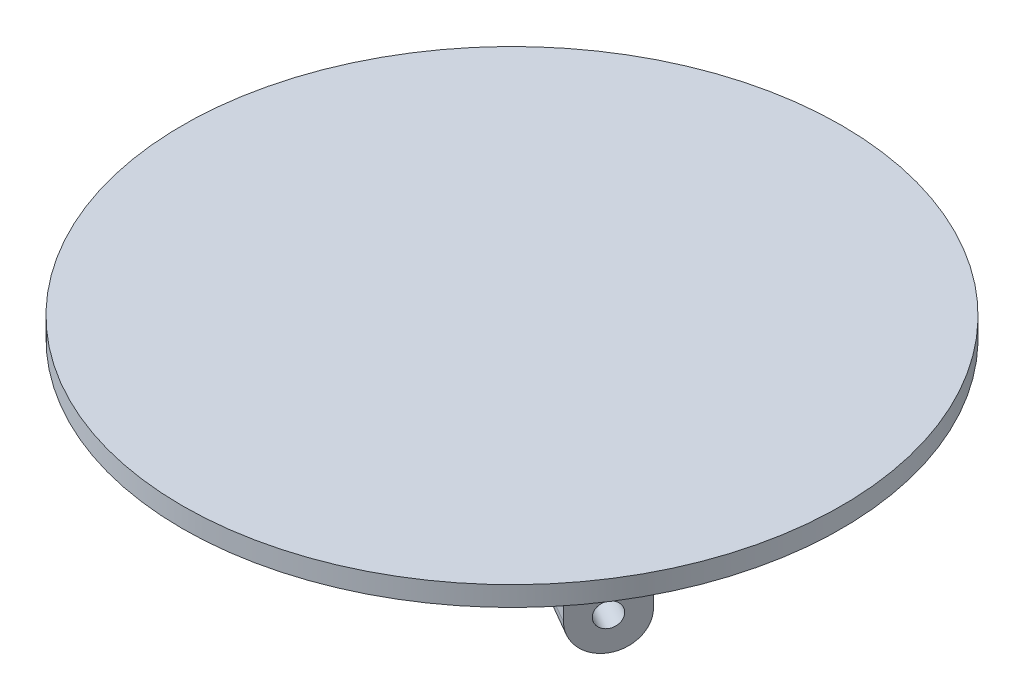
ISO-10303-21;
HEADER;
FILE_DESCRIPTION(('STEP AP214'),'2;1');
FILE_NAME('part.step','',(''),(''),'','','');
FILE_SCHEMA(('AUTOMOTIVE_DESIGN { 1 0 10303 214 1 1 1 1 }'));
ENDSEC;
DATA;
#1=APPLICATION_CONTEXT('core data for automotive mechanical design processes');
#2=APPLICATION_PROTOCOL_DEFINITION('international standard','automotive_design',2000,#1);
#3=PRODUCT_CONTEXT('',#1,'mechanical');
#4=PRODUCT('Part','Part','',(#3));
#5=PRODUCT_RELATED_PRODUCT_CATEGORY('part','',(#4));
#6=PRODUCT_DEFINITION_FORMATION('','',#4);
#7=PRODUCT_DEFINITION_CONTEXT('part definition',#1,'design');
#8=PRODUCT_DEFINITION('design','',#6,#7);
#9=PRODUCT_DEFINITION_SHAPE('','',#8);
#10=(LENGTH_UNIT() NAMED_UNIT(*) SI_UNIT(.MILLI.,.METRE.));
#11=(NAMED_UNIT(*) PLANE_ANGLE_UNIT() SI_UNIT($,.RADIAN.));
#12=(NAMED_UNIT(*) SI_UNIT($,.STERADIAN.) SOLID_ANGLE_UNIT());
#13=UNCERTAINTY_MEASURE_WITH_UNIT(LENGTH_MEASURE(1.E-05),#10,'distance_accuracy_value','');
#14=(GEOMETRIC_REPRESENTATION_CONTEXT(3) GLOBAL_UNCERTAINTY_ASSIGNED_CONTEXT((#13)) GLOBAL_UNIT_ASSIGNED_CONTEXT((#10,
#11,#12)) REPRESENTATION_CONTEXT('',''));
#15=CARTESIAN_POINT('',(0.,0.,0.));
#16=DIRECTION('',(0.,0.,1.));
#17=DIRECTION('',(1.,0.,0.));
#18=AXIS2_PLACEMENT_3D('',#15,#16,#17);
#19=CARTESIAN_POINT('',(4.99999999999984,17.,-40.));
#20=DIRECTION('',(-1.,0.,0.));
#21=DIRECTION('',(0.,0.,1.));
#22=AXIS2_PLACEMENT_3D('',#19,#20,#21);
#23=PLANE('',#22);
#24=DIRECTION('',(0.,-1.,0.));
#25=VECTOR('',#24,1.);
#26=CARTESIAN_POINT('',(4.99999999999984,17.,-40.));
#27=LINE('',#26,#25);
#28=CARTESIAN_POINT('',(4.99999999999984,12.,-40.));
#29=VERTEX_POINT('',#28);
#30=CARTESIAN_POINT('',(4.99999999999984,5.,-40.));
#31=VERTEX_POINT('',#30);
#32=EDGE_CURVE('E206',#29,#31,#27,.T.);
#33=ORIENTED_EDGE('',*,*,#32,.F.);
#34=DIRECTION('',(0.,0.,-1.));
#35=VECTOR('',#34,1.);
#36=CARTESIAN_POINT('',(4.99999999999985,12.,-35.));
#37=LINE('',#36,#35);
#38=CARTESIAN_POINT('',(4.99999999999993,12.,-35.));
#39=VERTEX_POINT('',#38);
#40=EDGE_CURVE('E304',#29,#39,#37,.F.);
#41=ORIENTED_EDGE('',*,*,#40,.T.);
#42=DIRECTION('',(0.,1.,0.));
#43=VECTOR('',#42,1.);
#44=CARTESIAN_POINT('',(4.99999999999993,0.,-35.));
#45=LINE('',#44,#43);
#46=CARTESIAN_POINT('',(4.99999999999993,5.,-35.));
#47=VERTEX_POINT('',#46);
#48=EDGE_CURVE('E190',#47,#39,#45,.T.);
#49=ORIENTED_EDGE('',*,*,#48,.F.);
#50=DIRECTION('',(0.,0.,-1.));
#51=VECTOR('',#50,1.);
#52=CARTESIAN_POINT('',(4.99999999999984,5.,-40.));
#53=LINE('',#52,#51);
#54=EDGE_CURVE('E215',#47,#31,#53,.T.);
#55=ORIENTED_EDGE('',*,*,#54,.T.);
#56=EDGE_LOOP('',(#33,#41,#49,#55));
#57=FACE_BOUND('',#56,.T.);
#58=ADVANCED_FACE('F39',(#57),#23,.F.);
#59=CARTESIAN_POINT('',(-5.00000000000016,17.,-40.));
#60=DIRECTION('',(0.,0.,1.));
#61=DIRECTION('',(1.,0.,0.));
#62=AXIS2_PLACEMENT_3D('',#59,#60,#61);
#63=PLANE('',#62);
#64=CARTESIAN_POINT('',(-1.78260027118137E-13,5.,-40.));
#65=DIRECTION('',(0.,0.,-1.));
#66=DIRECTION('',(-1.,0.,0.));
#67=AXIS2_PLACEMENT_3D('',#64,#65,#66);
#68=CIRCLE('',#67,1.79999999999999);
#69=CARTESIAN_POINT('',(-1.80000000000017,5.,-40.));
#70=VERTEX_POINT('',#69);
#71=EDGE_CURVE('E397',#70,#70,#68,.T.);
#72=ORIENTED_EDGE('',*,*,#71,.F.);
#73=EDGE_LOOP('',(#72));
#74=FACE_BOUND('',#73,.T.);
#75=DIRECTION('',(0.,-1.,0.));
#76=VECTOR('',#75,1.);
#77=CARTESIAN_POINT('',(-5.00000000000016,17.,-40.));
#78=LINE('',#77,#76);
#79=CARTESIAN_POINT('',(-5.00000000000016,12.,-40.));
#80=VERTEX_POINT('',#79);
#81=CARTESIAN_POINT('',(-5.00000000000016,5.,-40.));
#82=VERTEX_POINT('',#81);
#83=EDGE_CURVE('E204',#80,#82,#78,.T.);
#84=ORIENTED_EDGE('',*,*,#83,.F.);
#85=DIRECTION('',(-1.,0.,0.));
#86=VECTOR('',#85,1.);
#87=CARTESIAN_POINT('',(4.99999999999984,12.,-40.));
#88=LINE('',#87,#86);
#89=EDGE_CURVE('E11',#80,#29,#88,.F.);
#90=ORIENTED_EDGE('',*,*,#89,.T.);
#91=ORIENTED_EDGE('',*,*,#32,.T.);
#92=CARTESIAN_POINT('',(-1.63931368479808E-13,5.,-40.));
#93=DIRECTION('',(0.,0.,1.));
#94=DIRECTION('',(1.,0.,0.));
#95=AXIS2_PLACEMENT_3D('',#92,#93,#94);
#96=CIRCLE('',#95,5.);
#97=CARTESIAN_POINT('',(-1.63931368479808E-13,0.,-40.));
#98=VERTEX_POINT('',#97);
#99=EDGE_CURVE('E200',#31,#98,#96,.F.);
#100=ORIENTED_EDGE('',*,*,#99,.T.);
#101=CARTESIAN_POINT('',(-1.63931368479808E-13,5.,-40.));
#102=DIRECTION('',(0.,0.,1.));
#103=DIRECTION('',(1.,0.,0.));
#104=AXIS2_PLACEMENT_3D('',#101,#102,#103);
#105=CIRCLE('',#104,5.);
#106=EDGE_CURVE('E213',#98,#82,#105,.F.);
#107=ORIENTED_EDGE('',*,*,#106,.T.);
#108=EDGE_LOOP('',(#84,#90,#91,#100,#107));
#109=FACE_BOUND('',#108,.T.);
#110=ADVANCED_FACE('F411',(#74,#109),#63,.F.);
#111=CARTESIAN_POINT('',(-5.00000000000007,17.,-2.88675134594814));
#112=DIRECTION('',(1.,0.,0.));
#113=DIRECTION('',(0.,0.,-1.));
#114=AXIS2_PLACEMENT_3D('',#111,#112,#113);
#115=PLANE('',#114);
#116=DIRECTION('',(0.,-1.,0.));
#117=VECTOR('',#116,1.);
#118=CARTESIAN_POINT('',(-5.00000000000015,0.,-35.));
#119=LINE('',#118,#117);
#120=CARTESIAN_POINT('',(-5.00000000000015,12.,-35.));
#121=VERTEX_POINT('',#120);
#122=CARTESIAN_POINT('',(-5.00000000000015,5.,-35.));
#123=VERTEX_POINT('',#122);
#124=EDGE_CURVE('E181',#121,#123,#119,.T.);
#125=ORIENTED_EDGE('',*,*,#124,.F.);
#126=DIRECTION('',(0.,0.,1.));
#127=VECTOR('',#126,1.);
#128=CARTESIAN_POINT('',(-5.00000000000016,12.,-40.));
#129=LINE('',#128,#127);
#130=EDGE_CURVE('E48',#121,#80,#129,.F.);
#131=ORIENTED_EDGE('',*,*,#130,.T.);
#132=ORIENTED_EDGE('',*,*,#83,.T.);
#133=DIRECTION('',(0.,0.,1.));
#134=VECTOR('',#133,1.);
#135=CARTESIAN_POINT('',(-5.00000000000015,5.,-35.));
#136=LINE('',#135,#134);
#137=EDGE_CURVE('E198',#82,#123,#136,.T.);
#138=ORIENTED_EDGE('',*,*,#137,.T.);
#139=EDGE_LOOP('',(#125,#131,#132,#138));
#140=FACE_BOUND('',#139,.T.);
#141=ADVANCED_FACE('F203',(#140),#115,.F.);
#142=CARTESIAN_POINT('',(-37.1410161513774,17.,15.6698729810781));
#143=DIRECTION('',(0.500000000000006,0.,0.866025403784435));
#144=DIRECTION('',(0.866025403784435,0.,-0.500000000000006));
#145=AXIS2_PLACEMENT_3D('',#142,#143,#144);
#146=PLANE('',#145);
#147=DIRECTION('',(0.,-1.,0.));
#148=VECTOR('',#147,1.);
#149=CARTESIAN_POINT('',(-37.1410161513774,17.,15.6698729810781));
#150=LINE('',#149,#148);
#151=CARTESIAN_POINT('',(-37.1410161513774,12.,15.6698729810781));
#152=VERTEX_POINT('',#151);
#153=CARTESIAN_POINT('',(-37.1410161513774,5.,15.6698729810781));
#154=VERTEX_POINT('',#153);
#155=EDGE_CURVE('E395',#152,#154,#150,.T.);
#156=ORIENTED_EDGE('',*,*,#155,.F.);
#157=DIRECTION('',(-0.866025403784435,0.,0.500000000000006));
#158=VECTOR('',#157,1.);
#159=CARTESIAN_POINT('',(-32.8108891324552,12.,13.1698729810781));
#160=LINE('',#159,#158);
#161=CARTESIAN_POINT('',(-32.8108891324553,12.,13.169872981078));
#162=VERTEX_POINT('',#161);
#163=EDGE_CURVE('E285',#152,#162,#160,.F.);
#164=ORIENTED_EDGE('',*,*,#163,.T.);
#165=DIRECTION('',(0.,1.,0.));
#166=VECTOR('',#165,1.);
#167=CARTESIAN_POINT('',(-32.8108891324553,0.,13.169872981078));
#168=LINE('',#167,#166);
#169=CARTESIAN_POINT('',(-32.8108891324553,5.,13.169872981078));
#170=VERTEX_POINT('',#169);
#171=EDGE_CURVE('E386',#170,#162,#168,.T.);
#172=ORIENTED_EDGE('',*,*,#171,.F.);
#173=DIRECTION('',(-0.866025403784435,0.,0.500000000000006));
#174=VECTOR('',#173,1.);
#175=CARTESIAN_POINT('',(-37.1410161513774,5.,15.6698729810781));
#176=LINE('',#175,#174);
#177=EDGE_CURVE('E232',#170,#154,#176,.T.);
#178=ORIENTED_EDGE('',*,*,#177,.T.);
#179=EDGE_LOOP('',(#156,#164,#172,#178));
#180=FACE_BOUND('',#179,.T.);
#181=ADVANCED_FACE('F434',(#180),#146,.F.);
#182=CARTESIAN_POINT('',(-32.1410161513774,17.,24.3301270189225));
#183=DIRECTION('',(0.866025403784436,0.,-0.500000000000004));
#184=DIRECTION('',(-0.500000000000004,0.,-0.866025403784436));
#185=AXIS2_PLACEMENT_3D('',#182,#183,#184);
#186=PLANE('',#185);
#187=CARTESIAN_POINT('',(-34.6410161513774,5.,20.0000000000003));
#188=DIRECTION('',(-0.866025403784435,0.,0.500000000000006));
#189=DIRECTION('',(0.500000000000007,0.,0.866025403784435));
#190=AXIS2_PLACEMENT_3D('',#187,#188,#189);
#191=CIRCLE('',#190,1.79999999999999);
#192=CARTESIAN_POINT('',(-33.7410161513774,5.,21.5588457268123));
#193=VERTEX_POINT('',#192);
#194=EDGE_CURVE('E375',#193,#193,#191,.T.);
#195=ORIENTED_EDGE('',*,*,#194,.F.);
#196=EDGE_LOOP('',(#195));
#197=FACE_BOUND('',#196,.T.);
#198=DIRECTION('',(0.,-1.,0.));
#199=VECTOR('',#198,1.);
#200=CARTESIAN_POINT('',(-32.1410161513774,17.,24.3301270189225));
#201=LINE('',#200,#199);
#202=CARTESIAN_POINT('',(-32.1410161513774,12.,24.3301270189225));
#203=VERTEX_POINT('',#202);
#204=CARTESIAN_POINT('',(-32.1410161513774,5.,24.3301270189225));
#205=VERTEX_POINT('',#204);
#206=EDGE_CURVE('E393',#203,#205,#201,.T.);
#207=ORIENTED_EDGE('',*,*,#206,.F.);
#208=DIRECTION('',(0.500000000000004,0.,0.866025403784436));
#209=VECTOR('',#208,1.);
#210=CARTESIAN_POINT('',(-37.1410161513774,12.,15.6698729810781));
#211=LINE('',#210,#209);
#212=EDGE_CURVE('E290',#203,#152,#211,.F.);
#213=ORIENTED_EDGE('',*,*,#212,.T.);
#214=ORIENTED_EDGE('',*,*,#155,.T.);
#215=CARTESIAN_POINT('',(-34.6410161513774,5.,20.0000000000003));
#216=DIRECTION('',(0.866025403784436,0.,-0.500000000000004));
#217=DIRECTION('',(-0.500000000000004,0.,-0.866025403784436));
#218=AXIS2_PLACEMENT_3D('',#215,#216,#217);
#219=CIRCLE('',#218,5.);
#220=CARTESIAN_POINT('',(-34.6410161513774,0.,20.0000000000003));
#221=VERTEX_POINT('',#220);
#222=EDGE_CURVE('E227',#154,#221,#219,.F.);
#223=ORIENTED_EDGE('',*,*,#222,.T.);
#224=CARTESIAN_POINT('',(-34.6410161513774,5.,20.0000000000003));
#225=DIRECTION('',(0.866025403784436,0.,-0.500000000000004));
#226=DIRECTION('',(-0.500000000000004,0.,-0.866025403784436));
#227=AXIS2_PLACEMENT_3D('',#224,#225,#226);
#228=CIRCLE('',#227,5.);
#229=EDGE_CURVE('E229',#221,#205,#228,.F.);
#230=ORIENTED_EDGE('',*,*,#229,.T.);
#231=EDGE_LOOP('',(#207,#213,#214,#223,#230));
#232=FACE_BOUND('',#231,.T.);
#233=ADVANCED_FACE('F442',(#197,#232),#186,.F.);
#234=CARTESIAN_POINT('',(0.,17.,5.77350269189633));
#235=DIRECTION('',(-0.500000000000006,0.,-0.866025403784435));
#236=DIRECTION('',(-0.866025403784435,0.,0.500000000000006));
#237=AXIS2_PLACEMENT_3D('',#234,#235,#236);
#238=PLANE('',#237);
#239=DIRECTION('',(0.,-1.,0.));
#240=VECTOR('',#239,1.);
#241=CARTESIAN_POINT('',(-27.8108891324552,0.,21.8301270189224));
#242=LINE('',#241,#240);
#243=CARTESIAN_POINT('',(-27.8108891324552,12.,21.8301270189224));
#244=VERTEX_POINT('',#243);
#245=CARTESIAN_POINT('',(-27.8108891324552,5.,21.8301270189224));
#246=VERTEX_POINT('',#245);
#247=EDGE_CURVE('E384',#244,#246,#242,.T.);
#248=ORIENTED_EDGE('',*,*,#247,.F.);
#249=DIRECTION('',(0.866025403784435,0.,-0.500000000000006));
#250=VECTOR('',#249,1.);
#251=CARTESIAN_POINT('',(-32.1410161513774,12.,24.3301270189225));
#252=LINE('',#251,#250);
#253=EDGE_CURVE('E292',#244,#203,#252,.F.);
#254=ORIENTED_EDGE('',*,*,#253,.T.);
#255=ORIENTED_EDGE('',*,*,#206,.T.);
#256=DIRECTION('',(0.866025403784435,0.,-0.500000000000006));
#257=VECTOR('',#256,1.);
#258=CARTESIAN_POINT('',(-27.8108891324552,5.,21.8301270189225));
#259=LINE('',#258,#257);
#260=EDGE_CURVE('E218',#205,#246,#259,.T.);
#261=ORIENTED_EDGE('',*,*,#260,.T.);
#262=EDGE_LOOP('',(#248,#254,#255,#261));
#263=FACE_BOUND('',#262,.T.);
#264=ADVANCED_FACE('F446',(#263),#238,.F.);
#265=CARTESIAN_POINT('',(32.1410161513779,17.,24.3301270189218));
#266=DIRECTION('',(0.49999999999999,0.,-0.866025403784444));
#267=DIRECTION('',(-0.866025403784445,0.,-0.49999999999999));
#268=AXIS2_PLACEMENT_3D('',#265,#266,#267);
#269=PLANE('',#268);
#270=DIRECTION('',(0.,-1.,0.));
#271=VECTOR('',#270,1.);
#272=CARTESIAN_POINT('',(32.1410161513779,17.,24.3301270189218));
#273=LINE('',#272,#271);
#274=CARTESIAN_POINT('',(32.1410161513779,12.,24.3301270189218));
#275=VERTEX_POINT('',#274);
#276=CARTESIAN_POINT('',(32.1410161513779,5.,24.3301270189218));
#277=VERTEX_POINT('',#276);
#278=EDGE_CURVE('E391',#275,#277,#273,.T.);
#279=ORIENTED_EDGE('',*,*,#278,.F.);
#280=DIRECTION('',(0.866025403784445,0.,0.49999999999999));
#281=VECTOR('',#280,1.);
#282=CARTESIAN_POINT('',(27.8108891324556,12.,21.8301270189218));
#283=LINE('',#282,#281);
#284=CARTESIAN_POINT('',(27.8108891324556,12.,21.8301270189219));
#285=VERTEX_POINT('',#284);
#286=EDGE_CURVE('E294',#275,#285,#283,.F.);
#287=ORIENTED_EDGE('',*,*,#286,.T.);
#288=DIRECTION('',(0.,1.,0.));
#289=VECTOR('',#288,1.);
#290=CARTESIAN_POINT('',(27.8108891324556,0.,21.8301270189219));
#291=LINE('',#290,#289);
#292=CARTESIAN_POINT('',(27.8108891324556,5.,21.8301270189219));
#293=VERTEX_POINT('',#292);
#294=EDGE_CURVE('E381',#293,#285,#291,.T.);
#295=ORIENTED_EDGE('',*,*,#294,.F.);
#296=DIRECTION('',(0.866025403784445,0.,0.49999999999999));
#297=VECTOR('',#296,1.);
#298=CARTESIAN_POINT('',(32.1410161513779,5.,24.3301270189218));
#299=LINE('',#298,#297);
#300=EDGE_CURVE('E252',#293,#277,#299,.T.);
#301=ORIENTED_EDGE('',*,*,#300,.T.);
#302=EDGE_LOOP('',(#279,#287,#295,#301));
#303=FACE_BOUND('',#302,.T.);
#304=ADVANCED_FACE('F450',(#303),#269,.F.);
#305=CARTESIAN_POINT('',(37.1410161513778,17.,15.6698729810773));
#306=DIRECTION('',(-0.866025403784443,0.,-0.499999999999992));
#307=DIRECTION('',(-0.499999999999992,0.,0.866025403784443));
#308=AXIS2_PLACEMENT_3D('',#305,#306,#307);
#309=PLANE('',#308);
#310=CARTESIAN_POINT('',(34.6410161513778,5.,19.9999999999995));
#311=DIRECTION('',(0.866025403784445,0.,0.49999999999999));
#312=DIRECTION('',(0.49999999999999,0.,-0.866025403784445));
#313=AXIS2_PLACEMENT_3D('',#310,#311,#312);
#314=CIRCLE('',#313,1.79999999999999);
#315=CARTESIAN_POINT('',(35.5410161513778,5.,18.4411542731875));
#316=VERTEX_POINT('',#315);
#317=EDGE_CURVE('E367',#316,#316,#314,.T.);
#318=ORIENTED_EDGE('',*,*,#317,.F.);
#319=EDGE_LOOP('',(#318));
#320=FACE_BOUND('',#319,.T.);
#321=DIRECTION('',(0.,-1.,0.));
#322=VECTOR('',#321,1.);
#323=CARTESIAN_POINT('',(37.1410161513778,17.,15.6698729810773));
#324=LINE('',#323,#322);
#325=CARTESIAN_POINT('',(37.1410161513778,12.,15.6698729810773));
#326=VERTEX_POINT('',#325);
#327=CARTESIAN_POINT('',(37.1410161513778,5.,15.6698729810773));
#328=VERTEX_POINT('',#327);
#329=EDGE_CURVE('E389',#326,#328,#324,.T.);
#330=ORIENTED_EDGE('',*,*,#329,.F.);
#331=DIRECTION('',(0.499999999999992,0.,-0.866025403784443));
#332=VECTOR('',#331,1.);
#333=CARTESIAN_POINT('',(32.1410161513779,12.,24.3301270189218));
#334=LINE('',#333,#332);
#335=EDGE_CURVE('E297',#326,#275,#334,.F.);
#336=ORIENTED_EDGE('',*,*,#335,.T.);
#337=ORIENTED_EDGE('',*,*,#278,.T.);
#338=CARTESIAN_POINT('',(34.6410161513778,5.,19.9999999999995));
#339=DIRECTION('',(-0.866025403784443,0.,-0.499999999999992));
#340=DIRECTION('',(-0.499999999999992,0.,0.866025403784443));
#341=AXIS2_PLACEMENT_3D('',#338,#339,#340);
#342=CIRCLE('',#341,5.);
#343=CARTESIAN_POINT('',(34.6410161513778,0.,19.9999999999995));
#344=VERTEX_POINT('',#343);
#345=EDGE_CURVE('E247',#277,#344,#342,.F.);
#346=ORIENTED_EDGE('',*,*,#345,.T.);
#347=CARTESIAN_POINT('',(34.6410161513778,5.,19.9999999999995));
#348=DIRECTION('',(-0.866025403784443,0.,-0.499999999999992));
#349=DIRECTION('',(-0.499999999999992,0.,0.866025403784443));
#350=AXIS2_PLACEMENT_3D('',#347,#348,#349);
#351=CIRCLE('',#350,5.);
#352=EDGE_CURVE('E249',#344,#328,#351,.F.);
#353=ORIENTED_EDGE('',*,*,#352,.T.);
#354=EDGE_LOOP('',(#330,#336,#337,#346,#353));
#355=FACE_BOUND('',#354,.T.);
#356=ADVANCED_FACE('F454',(#320,#355),#309,.F.);
#357=CARTESIAN_POINT('',(5.00000000000002,17.,-2.88675134594823));
#358=DIRECTION('',(-0.49999999999999,0.,0.866025403784444));
#359=DIRECTION('',(0.866025403784445,0.,0.49999999999999));
#360=AXIS2_PLACEMENT_3D('',#357,#358,#359);
#361=PLANE('',#360);
#362=DIRECTION('',(0.,-1.,0.));
#363=VECTOR('',#362,1.);
#364=CARTESIAN_POINT('',(32.8108891324555,0.,13.1698729810774));
#365=LINE('',#364,#363);
#366=CARTESIAN_POINT('',(32.8108891324555,12.,13.1698729810774));
#367=VERTEX_POINT('',#366);
#368=CARTESIAN_POINT('',(32.8108891324555,5.,13.1698729810774));
#369=VERTEX_POINT('',#368);
#370=EDGE_CURVE('E239',#367,#369,#365,.T.);
#371=ORIENTED_EDGE('',*,*,#370,.F.);
#372=DIRECTION('',(-0.866025403784445,0.,-0.49999999999999));
#373=VECTOR('',#372,1.);
#374=CARTESIAN_POINT('',(37.1410161513778,12.,15.6698729810773));
#375=LINE('',#374,#373);
#376=EDGE_CURVE('E301',#367,#326,#375,.F.);
#377=ORIENTED_EDGE('',*,*,#376,.T.);
#378=ORIENTED_EDGE('',*,*,#329,.T.);
#379=DIRECTION('',(-0.866025403784445,0.,-0.49999999999999));
#380=VECTOR('',#379,1.);
#381=CARTESIAN_POINT('',(32.8108891324556,5.,13.1698729810774));
#382=LINE('',#381,#380);
#383=EDGE_CURVE('E235',#328,#369,#382,.T.);
#384=ORIENTED_EDGE('',*,*,#383,.T.);
#385=EDGE_LOOP('',(#371,#377,#378,#384));
#386=FACE_BOUND('',#385,.T.);
#387=ADVANCED_FACE('F358',(#386),#361,.F.);
#388=CARTESIAN_POINT('',(-5.00100000000016,14.,0.));
#389=DIRECTION('',(0.,1.,0.));
#390=DIRECTION('',(0.,0.,1.));
#391=AXIS2_PLACEMENT_3D('',#388,#389,#390);
#392=PLANE('',#391);
#393=DIRECTION('',(-0.500000000000004,0.,-0.866025403784436));
#394=VECTOR('',#393,1.);
#395=CARTESIAN_POINT('',(-31.0788383248863,14.,12.1698729810781));
#396=LINE('',#395,#394);
#397=CARTESIAN_POINT('',(-25.0788383248863,14.,22.5621778264913));
#398=VERTEX_POINT('',#397);
#399=CARTESIAN_POINT('',(-32.0788383248864,14.,10.4378221735092));
#400=VERTEX_POINT('',#399);
#401=EDGE_CURVE('E280',#398,#400,#396,.T.);
#402=ORIENTED_EDGE('',*,*,#401,.T.);
#403=DIRECTION('',(-0.866025403784435,0.,0.500000000000006));
#404=VECTOR('',#403,1.);
#405=CARTESIAN_POINT('',(-38.1410161513774,14.,13.9378221735093));
#406=LINE('',#405,#404);
#407=CARTESIAN_POINT('',(-39.8730669589463,14.,14.9378221735093));
#408=VERTEX_POINT('',#407);
#409=EDGE_CURVE('E282',#400,#408,#406,.T.);
#410=ORIENTED_EDGE('',*,*,#409,.T.);
#411=DIRECTION('',(0.500000000000004,0.,0.866025403784436));
#412=VECTOR('',#411,1.);
#413=CARTESIAN_POINT('',(-33.8730669589462,14.,25.3301270189225));
#414=LINE('',#413,#412);
#415=CARTESIAN_POINT('',(-32.8730669589462,14.,27.0621778264914));
#416=VERTEX_POINT('',#415);
#417=EDGE_CURVE('E278',#408,#416,#414,.T.);
#418=ORIENTED_EDGE('',*,*,#417,.T.);
#419=DIRECTION('',(0.866025403784435,0.,-0.500000000000006));
#420=VECTOR('',#419,1.);
#421=CARTESIAN_POINT('',(-26.8108891324552,14.,23.5621778264913));
#422=LINE('',#421,#420);
#423=EDGE_CURVE('E276',#416,#398,#422,.T.);
#424=ORIENTED_EDGE('',*,*,#423,.T.);
#425=EDGE_LOOP('',(#402,#410,#418,#424));
#426=FACE_BOUND('',#425,.T.);
#427=DIRECTION('',(-0.499999999999992,0.,0.866025403784443));
#428=VECTOR('',#427,1.);
#429=CARTESIAN_POINT('',(26.0788383248867,14.,20.8301270189219));
#430=LINE('',#429,#428);
#431=CARTESIAN_POINT('',(32.0788383248866,14.,10.4378221735085));
#432=VERTEX_POINT('',#431);
#433=CARTESIAN_POINT('',(25.0788383248867,14.,22.5621778264907));
#434=VERTEX_POINT('',#433);
#435=EDGE_CURVE('E269',#432,#434,#430,.T.);
#436=ORIENTED_EDGE('',*,*,#435,.T.);
#437=DIRECTION('',(0.866025403784445,0.,0.49999999999999));
#438=VECTOR('',#437,1.);
#439=CARTESIAN_POINT('',(31.1410161513779,14.,26.0621778264907));
#440=LINE('',#439,#438);
#441=CARTESIAN_POINT('',(32.8730669589468,14.,27.0621778264906));
#442=VERTEX_POINT('',#441);
#443=EDGE_CURVE('E273',#434,#442,#440,.T.);
#444=ORIENTED_EDGE('',*,*,#443,.T.);
#445=DIRECTION('',(0.499999999999992,0.,-0.866025403784443));
#446=VECTOR('',#445,1.);
#447=CARTESIAN_POINT('',(38.8730669589467,14.,16.6698729810773));
#448=LINE('',#447,#446);
#449=CARTESIAN_POINT('',(39.8730669589466,14.,14.9378221735084));
#450=VERTEX_POINT('',#449);
#451=EDGE_CURVE('E271',#442,#450,#448,.T.);
#452=ORIENTED_EDGE('',*,*,#451,.T.);
#453=DIRECTION('',(-0.866025403784445,0.,-0.49999999999999));
#454=VECTOR('',#453,1.);
#455=CARTESIAN_POINT('',(33.8108891324555,14.,11.4378221735085));
#456=LINE('',#455,#454);
#457=EDGE_CURVE('E267',#450,#432,#456,.T.);
#458=ORIENTED_EDGE('',*,*,#457,.T.);
#459=EDGE_LOOP('',(#436,#444,#452,#458));
#460=FACE_BOUND('',#459,.T.);
#461=DIRECTION('',(0.,0.,1.));
#462=VECTOR('',#461,1.);
#463=CARTESIAN_POINT('',(-7.00000000000015,14.,-35.));
#464=LINE('',#463,#462);
#465=CARTESIAN_POINT('',(-7.00000000000017,14.,-42.));
#466=VERTEX_POINT('',#465);
#467=CARTESIAN_POINT('',(-7.00000000000015,14.,-33.));
#468=VERTEX_POINT('',#467);
#469=EDGE_CURVE('E260',#466,#468,#464,.T.);
#470=ORIENTED_EDGE('',*,*,#469,.T.);
#471=DIRECTION('',(1.,0.,0.));
#472=VECTOR('',#471,1.);
#473=CARTESIAN_POINT('',(4.99999999999985,14.,-33.));
#474=LINE('',#473,#472);
#475=CARTESIAN_POINT('',(6.99999999999986,14.,-33.));
#476=VERTEX_POINT('',#475);
#477=EDGE_CURVE('E264',#468,#476,#474,.T.);
#478=ORIENTED_EDGE('',*,*,#477,.T.);
#479=DIRECTION('',(0.,0.,-1.));
#480=VECTOR('',#479,1.);
#481=CARTESIAN_POINT('',(6.99999999999984,14.,-40.));
#482=LINE('',#481,#480);
#483=CARTESIAN_POINT('',(6.99999999999983,14.,-42.));
#484=VERTEX_POINT('',#483);
#485=EDGE_CURVE('E262',#476,#484,#482,.T.);
#486=ORIENTED_EDGE('',*,*,#485,.T.);
#487=DIRECTION('',(-1.,0.,0.));
#488=VECTOR('',#487,1.);
#489=CARTESIAN_POINT('',(-5.00000000000016,14.,-42.));
#490=LINE('',#489,#488);
#491=EDGE_CURVE('E255',#484,#466,#490,.T.);
#492=ORIENTED_EDGE('',*,*,#491,.T.);
#493=EDGE_LOOP('',(#470,#478,#486,#492));
#494=FACE_BOUND('',#493,.T.);
#495=CARTESIAN_POINT('',(0.,14.,0.));
#496=DIRECTION('',(0.,1.,0.));
#497=DIRECTION('',(0.,0.,1.));
#498=AXIS2_PLACEMENT_3D('',#495,#496,#497);
#499=CIRCLE('',#498,50.);
#500=CARTESIAN_POINT('',(0.,14.,50.));
#501=VERTEX_POINT('',#500);
#502=EDGE_CURVE('E318',#501,#501,#499,.T.);
#503=ORIENTED_EDGE('',*,*,#502,.F.);
#504=EDGE_LOOP('',(#503));
#505=FACE_BOUND('',#504,.T.);
#506=ADVANCED_FACE('F355',(#426,#460,#494,#505),#392,.F.);
#507=CARTESIAN_POINT('',(-5.00100000000017,0.,-35.));
#508=DIRECTION('',(0.,0.,-1.));
#509=DIRECTION('',(-1.,0.,0.));
#510=AXIS2_PLACEMENT_3D('',#507,#508,#509);
#511=PLANE('',#510);
#512=CARTESIAN_POINT('',(-1.78260027118137E-13,5.,-35.));
#513=DIRECTION('',(0.,0.,-1.));
#514=DIRECTION('',(-1.,0.,0.));
#515=AXIS2_PLACEMENT_3D('',#512,#513,#514);
#516=CIRCLE('',#515,1.79999999999999);
#517=CARTESIAN_POINT('',(-1.80000000000017,5.,-35.));
#518=VERTEX_POINT('',#517);
#519=EDGE_CURVE('E220',#518,#518,#516,.T.);
#520=ORIENTED_EDGE('',*,*,#519,.T.);
#521=EDGE_LOOP('',(#520));
#522=FACE_BOUND('',#521,.T.);
#523=ORIENTED_EDGE('',*,*,#48,.T.);
#524=DIRECTION('',(1.,0.,0.));
#525=VECTOR('',#524,1.);
#526=CARTESIAN_POINT('',(-5.00000000000015,12.,-35.));
#527=LINE('',#526,#525);
#528=EDGE_CURVE('E188',#39,#121,#527,.F.);
#529=ORIENTED_EDGE('',*,*,#528,.T.);
#530=ORIENTED_EDGE('',*,*,#124,.T.);
#531=CARTESIAN_POINT('',(-1.51778616562071E-13,5.,-35.));
#532=DIRECTION('',(0.,0.,-1.));
#533=DIRECTION('',(-1.,0.,0.));
#534=AXIS2_PLACEMENT_3D('',#531,#532,#533);
#535=CIRCLE('',#534,5.);
#536=CARTESIAN_POINT('',(-1.51788304147971E-13,0.,-35.));
#537=VERTEX_POINT('',#536);
#538=EDGE_CURVE('E185',#123,#537,#535,.F.);
#539=ORIENTED_EDGE('',*,*,#538,.T.);
#540=CARTESIAN_POINT('',(-1.51428056410598E-13,5.,-35.));
#541=DIRECTION('',(0.,0.,-1.));
#542=DIRECTION('',(-1.,0.,0.));
#543=AXIS2_PLACEMENT_3D('',#540,#541,#542);
#544=CIRCLE('',#543,5.);
#545=EDGE_CURVE('E201',#537,#47,#544,.F.);
#546=ORIENTED_EDGE('',*,*,#545,.T.);
#547=EDGE_LOOP('',(#523,#529,#530,#539,#546));
#548=FACE_BOUND('',#547,.T.);
#549=ADVANCED_FACE('F184',(#522,#548),#511,.F.);
#550=CARTESIAN_POINT('',(-1.63931368479808E-13,5.,-40.));
#551=DIRECTION('',(0.,0.,1.));
#552=DIRECTION('',(1.,0.,0.));
#553=AXIS2_PLACEMENT_3D('',#550,#551,#552);
#554=CYLINDRICAL_SURFACE('',#553,5.);
#555=DIRECTION('',(0.,0.,-1.));
#556=VECTOR('',#555,1.);
#557=CARTESIAN_POINT('',(-1.51428056410598E-13,0.,-35.));
#558=LINE('',#557,#556);
#559=EDGE_CURVE('E191',#98,#537,#558,.F.);
#560=ORIENTED_EDGE('',*,*,#559,.F.);
#561=ORIENTED_EDGE('',*,*,#99,.F.);
#562=ORIENTED_EDGE('',*,*,#54,.F.);
#563=ORIENTED_EDGE('',*,*,#545,.F.);
#564=EDGE_LOOP('',(#560,#561,#562,#563));
#565=FACE_BOUND('',#564,.T.);
#566=ADVANCED_FACE('F416',(#565),#554,.T.);
#567=CARTESIAN_POINT('',(0.,5.,-2.88675134594815));
#568=DIRECTION('',(0.,0.,-1.));
#569=DIRECTION('',(-1.,0.,0.));
#570=AXIS2_PLACEMENT_3D('',#567,#568,#569);
#571=CYLINDRICAL_SURFACE('',#570,5.);
#572=ORIENTED_EDGE('',*,*,#106,.F.);
#573=ORIENTED_EDGE('',*,*,#559,.T.);
#574=ORIENTED_EDGE('',*,*,#538,.F.);
#575=ORIENTED_EDGE('',*,*,#137,.F.);
#576=EDGE_LOOP('',(#572,#573,#574,#575));
#577=FACE_BOUND('',#576,.T.);
#578=ADVANCED_FACE('F197',(#577),#571,.T.);
#579=CARTESIAN_POINT('',(-1.78260027118137E-13,5.,-40.));
#580=DIRECTION('',(0.,0.,-1.));
#581=DIRECTION('',(-1.,0.,0.));
#582=AXIS2_PLACEMENT_3D('',#579,#580,#581);
#583=CYLINDRICAL_SURFACE('',#582,1.79999999999999);
#584=ORIENTED_EDGE('',*,*,#519,.F.);
#585=EDGE_LOOP('',(#584));
#586=FACE_BOUND('',#585,.T.);
#587=ORIENTED_EDGE('',*,*,#71,.T.);
#588=EDGE_LOOP('',(#587));
#589=FACE_BOUND('',#588,.T.);
#590=ADVANCED_FACE('F404',(#586,#589),#583,.F.);
#591=CARTESIAN_POINT('',(-10.4896980440642,0.,51.8313100316245));
#592=DIRECTION('',(-0.866025403784436,0.,0.500000000000004));
#593=DIRECTION('',(0.500000000000004,0.,0.866025403784436));
#594=AXIS2_PLACEMENT_3D('',#591,#592,#593);
#595=PLANE('',#594);
#596=CARTESIAN_POINT('',(-30.3108891324552,5.,17.5000000000003));
#597=DIRECTION('',(-0.866025403784436,0.,0.500000000000004));
#598=DIRECTION('',(0.500000000000004,0.,0.866025403784436));
#599=AXIS2_PLACEMENT_3D('',#596,#597,#598);
#600=CIRCLE('',#599,1.79999999999999);
#601=CARTESIAN_POINT('',(-29.4108891324552,5.,19.0588457268123));
#602=VERTEX_POINT('',#601);
#603=EDGE_CURVE('E258',#602,#602,#600,.T.);
#604=ORIENTED_EDGE('',*,*,#603,.T.);
#605=EDGE_LOOP('',(#604));
#606=FACE_BOUND('',#605,.T.);
#607=ORIENTED_EDGE('',*,*,#171,.T.);
#608=DIRECTION('',(-0.500000000000004,0.,-0.866025403784436));
#609=VECTOR('',#608,1.);
#610=CARTESIAN_POINT('',(-27.8108891324552,12.,21.8301270189224));
#611=LINE('',#610,#609);
#612=EDGE_CURVE('E288',#162,#244,#611,.F.);
#613=ORIENTED_EDGE('',*,*,#612,.T.);
#614=ORIENTED_EDGE('',*,*,#247,.T.);
#615=CARTESIAN_POINT('',(-30.3108891324552,5.,17.5000000000003));
#616=DIRECTION('',(-0.866025403784436,0.,0.500000000000004));
#617=DIRECTION('',(0.500000000000004,0.,0.866025403784436));
#618=AXIS2_PLACEMENT_3D('',#615,#616,#617);
#619=CIRCLE('',#618,5.);
#620=CARTESIAN_POINT('',(-30.3108891324552,0.,17.5000000000003));
#621=VERTEX_POINT('',#620);
#622=EDGE_CURVE('E225',#246,#621,#619,.F.);
#623=ORIENTED_EDGE('',*,*,#622,.T.);
#624=CARTESIAN_POINT('',(-30.3108891324552,5.,17.5000000000003));
#625=DIRECTION('',(-0.866025403784436,0.,0.500000000000004));
#626=DIRECTION('',(0.500000000000004,0.,0.866025403784436));
#627=AXIS2_PLACEMENT_3D('',#624,#625,#626);
#628=CIRCLE('',#627,5.);
#629=EDGE_CURVE('E223',#621,#170,#628,.F.);
#630=ORIENTED_EDGE('',*,*,#629,.T.);
#631=EDGE_LOOP('',(#607,#613,#614,#623,#630));
#632=FACE_BOUND('',#631,.T.);
#633=ADVANCED_FACE('F407',(#606,#632),#595,.F.);
#634=CARTESIAN_POINT('',(56.9173342586901,0.,-28.583714767433));
#635=DIRECTION('',(0.866025403784443,0.,0.499999999999992));
#636=DIRECTION('',(0.499999999999992,0.,-0.866025403784443));
#637=AXIS2_PLACEMENT_3D('',#634,#635,#636);
#638=PLANE('',#637);
#639=CARTESIAN_POINT('',(30.3108891324556,5.,17.4999999999996));
#640=DIRECTION('',(0.866025403784443,0.,0.499999999999992));
#641=DIRECTION('',(0.499999999999992,0.,-0.866025403784443));
#642=AXIS2_PLACEMENT_3D('',#639,#640,#641);
#643=CIRCLE('',#642,1.79999999999999);
#644=CARTESIAN_POINT('',(31.2108891324556,5.,15.9411542731876));
#645=VERTEX_POINT('',#644);
#646=EDGE_CURVE('E372',#645,#645,#643,.T.);
#647=ORIENTED_EDGE('',*,*,#646,.T.);
#648=EDGE_LOOP('',(#647));
#649=FACE_BOUND('',#648,.T.);
#650=ORIENTED_EDGE('',*,*,#294,.T.);
#651=DIRECTION('',(-0.499999999999992,0.,0.866025403784443));
#652=VECTOR('',#651,1.);
#653=CARTESIAN_POINT('',(32.8108891324555,12.,13.1698729810774));
#654=LINE('',#653,#652);
#655=EDGE_CURVE('E299',#285,#367,#654,.F.);
#656=ORIENTED_EDGE('',*,*,#655,.T.);
#657=ORIENTED_EDGE('',*,*,#370,.T.);
#658=CARTESIAN_POINT('',(30.3108891324556,5.,17.4999999999996));
#659=DIRECTION('',(0.866025403784443,0.,0.499999999999992));
#660=DIRECTION('',(0.499999999999992,0.,-0.866025403784443));
#661=AXIS2_PLACEMENT_3D('',#658,#659,#660);
#662=CIRCLE('',#661,5.);
#663=CARTESIAN_POINT('',(30.3108891324556,0.,17.4999999999996));
#664=VERTEX_POINT('',#663);
#665=EDGE_CURVE('E245',#369,#664,#662,.F.);
#666=ORIENTED_EDGE('',*,*,#665,.T.);
#667=CARTESIAN_POINT('',(30.3108891324556,5.,17.4999999999996));
#668=DIRECTION('',(0.866025403784443,0.,0.499999999999992));
#669=DIRECTION('',(0.499999999999992,0.,-0.866025403784443));
#670=AXIS2_PLACEMENT_3D('',#667,#668,#669);
#671=CIRCLE('',#670,5.);
#672=EDGE_CURVE('E243',#664,#293,#671,.F.);
#673=ORIENTED_EDGE('',*,*,#672,.T.);
#674=EDGE_LOOP('',(#650,#656,#657,#666,#673));
#675=FACE_BOUND('',#674,.T.);
#676=ADVANCED_FACE('F464',(#649,#675),#638,.F.);
#677=CARTESIAN_POINT('',(-34.6410161513774,5.,20.0000000000003));
#678=DIRECTION('',(0.866025403784435,0.,-0.500000000000006));
#679=DIRECTION('',(-0.500000000000006,0.,-0.866025403784435));
#680=AXIS2_PLACEMENT_3D('',#677,#678,#679);
#681=CYLINDRICAL_SURFACE('',#680,5.);
#682=DIRECTION('',(-0.866025403784435,0.,0.500000000000006));
#683=VECTOR('',#682,1.);
#684=CARTESIAN_POINT('',(-30.3108891324552,0.,17.5000000000003));
#685=LINE('',#684,#683);
#686=EDGE_CURVE('E236',#221,#621,#685,.F.);
#687=ORIENTED_EDGE('',*,*,#686,.F.);
#688=ORIENTED_EDGE('',*,*,#222,.F.);
#689=ORIENTED_EDGE('',*,*,#177,.F.);
#690=ORIENTED_EDGE('',*,*,#629,.F.);
#691=EDGE_LOOP('',(#687,#688,#689,#690));
#692=FACE_BOUND('',#691,.T.);
#693=ADVANCED_FACE('F468',(#692),#681,.T.);
#694=CARTESIAN_POINT('',(-2.49999999999998,5.,1.44337567297415));
#695=DIRECTION('',(-0.866025403784435,0.,0.500000000000006));
#696=DIRECTION('',(0.500000000000006,0.,0.866025403784435));
#697=AXIS2_PLACEMENT_3D('',#694,#695,#696);
#698=CYLINDRICAL_SURFACE('',#697,5.);
#699=ORIENTED_EDGE('',*,*,#229,.F.);
#700=ORIENTED_EDGE('',*,*,#686,.T.);
#701=ORIENTED_EDGE('',*,*,#622,.F.);
#702=ORIENTED_EDGE('',*,*,#260,.F.);
#703=EDGE_LOOP('',(#699,#700,#701,#702));
#704=FACE_BOUND('',#703,.T.);
#705=ADVANCED_FACE('F612',(#704),#698,.T.);
#706=CARTESIAN_POINT('',(34.6410161513778,5.,19.9999999999995));
#707=DIRECTION('',(-0.866025403784445,0.,-0.49999999999999));
#708=DIRECTION('',(-0.49999999999999,0.,0.866025403784444));
#709=AXIS2_PLACEMENT_3D('',#706,#707,#708);
#710=CYLINDRICAL_SURFACE('',#709,5.);
#711=DIRECTION('',(0.866025403784445,0.,0.49999999999999));
#712=VECTOR('',#711,1.);
#713=CARTESIAN_POINT('',(30.3108891324556,0.,17.4999999999996));
#714=LINE('',#713,#712);
#715=EDGE_CURVE('E240',#344,#664,#714,.F.);
#716=ORIENTED_EDGE('',*,*,#715,.F.);
#717=ORIENTED_EDGE('',*,*,#345,.F.);
#718=ORIENTED_EDGE('',*,*,#300,.F.);
#719=ORIENTED_EDGE('',*,*,#672,.F.);
#720=EDGE_LOOP('',(#716,#717,#718,#719));
#721=FACE_BOUND('',#720,.T.);
#722=ADVANCED_FACE('F609',(#721),#710,.T.);
#723=CARTESIAN_POINT('',(2.50000000000007,5.,1.44337567297399));
#724=DIRECTION('',(0.866025403784445,0.,0.49999999999999));
#725=DIRECTION('',(0.49999999999999,0.,-0.866025403784444));
#726=AXIS2_PLACEMENT_3D('',#723,#724,#725);
#727=CYLINDRICAL_SURFACE('',#726,5.);
#728=ORIENTED_EDGE('',*,*,#352,.F.);
#729=ORIENTED_EDGE('',*,*,#715,.T.);
#730=ORIENTED_EDGE('',*,*,#665,.F.);
#731=ORIENTED_EDGE('',*,*,#383,.F.);
#732=EDGE_LOOP('',(#728,#729,#730,#731));
#733=FACE_BOUND('',#732,.T.);
#734=ADVANCED_FACE('F474',(#733),#727,.T.);
#735=CARTESIAN_POINT('',(-34.6410161513774,5.,20.0000000000003));
#736=DIRECTION('',(-0.866025403784435,0.,0.500000000000006));
#737=DIRECTION('',(0.500000000000007,0.,0.866025403784435));
#738=AXIS2_PLACEMENT_3D('',#735,#736,#737);
#739=CYLINDRICAL_SURFACE('',#738,1.79999999999999);
#740=CARTESIAN_POINT('',(-29.4108891324552,5.,19.0588457268123));
#741=CARTESIAN_POINT('',(-29.4559946222356,5.,19.0848873934789));
#742=CARTESIAN_POINT('',(-29.5011001120161,5.,19.1109290601456));
#743=CARTESIAN_POINT('',(-29.5913110915769,5.,19.1630123934789));
#744=CARTESIAN_POINT('',(-29.6364165813574,5.,19.1890540601456));
#745=CARTESIAN_POINT('',(-29.7266275609183,5.,19.2411373934789));
#746=CARTESIAN_POINT('',(-29.7717330506987,5.,19.2671790601456));
#747=CARTESIAN_POINT('',(-29.8619440302596,5.,19.3192623934789));
#748=CARTESIAN_POINT('',(-29.90704952004,5.,19.3453040601456));
#749=CARTESIAN_POINT('',(-29.9972604996009,5.,19.3973873934789));
#750=CARTESIAN_POINT('',(-30.0423659893813,5.,19.4234290601456));
#751=CARTESIAN_POINT('',(-30.1325769689422,5.,19.4755123934789));
#752=CARTESIAN_POINT('',(-30.1776824587226,5.,19.5015540601456));
#753=CARTESIAN_POINT('',(-30.2678934382835,5.,19.5536373934789));
#754=CARTESIAN_POINT('',(-30.312998928064,5.,19.5796790601456));
#755=CARTESIAN_POINT('',(-30.4032099076248,5.,19.6317623934789));
#756=CARTESIAN_POINT('',(-30.4483153974053,5.,19.6578040601456));
#757=CARTESIAN_POINT('',(-30.5385263769662,5.,19.7098873934789));
#758=CARTESIAN_POINT('',(-30.5836318667466,5.,19.7359290601456));
#759=CARTESIAN_POINT('',(-30.6738428463075,5.,19.7880123934789));
#760=CARTESIAN_POINT('',(-30.7189483360879,5.,19.8140540601456));
#761=CARTESIAN_POINT('',(-30.8091593156488,5.,19.8661373934789));
#762=CARTESIAN_POINT('',(-30.8542648054292,5.,19.8921790601456));
#763=CARTESIAN_POINT('',(-30.9444757849901,5.,19.9442623934789));
#764=CARTESIAN_POINT('',(-30.9895812747706,5.,19.9703040601456));
#765=CARTESIAN_POINT('',(-31.0797922543314,5.,20.0223873934789));
#766=CARTESIAN_POINT('',(-31.1248977441119,5.,20.0484290601456));
#767=CARTESIAN_POINT('',(-31.2151087236728,5.,20.1005123934789));
#768=CARTESIAN_POINT('',(-31.2602142134532,5.,20.1265540601456));
#769=CARTESIAN_POINT('',(-31.3504251930141,5.,20.1786373934789));
#770=CARTESIAN_POINT('',(-31.3955306827945,5.,20.2046790601456));
#771=CARTESIAN_POINT('',(-31.4857416623554,5.,20.2567623934789));
#772=CARTESIAN_POINT('',(-31.5308471521358,5.,20.2828040601456));
#773=CARTESIAN_POINT('',(-31.6210581316967,5.,20.3348873934789));
#774=CARTESIAN_POINT('',(-31.6661636214772,5.,20.3609290601456));
#775=CARTESIAN_POINT('',(-31.756374601038,5.,20.4130123934789));
#776=CARTESIAN_POINT('',(-31.8014800908185,5.,20.4390540601456));
#777=CARTESIAN_POINT('',(-31.8916910703793,5.,20.4911373934789));
#778=CARTESIAN_POINT('',(-31.9367965601598,5.,20.5171790601456));
#779=CARTESIAN_POINT('',(-32.0270075397207,5.,20.5692623934789));
#780=CARTESIAN_POINT('',(-32.0721130295011,5.,20.5953040601456));
#781=CARTESIAN_POINT('',(-32.162324009062,5.,20.6473873934789));
#782=CARTESIAN_POINT('',(-32.2074294988424,5.,20.6734290601456));
#783=CARTESIAN_POINT('',(-32.2976404784033,5.,20.7255123934789));
#784=CARTESIAN_POINT('',(-32.3427459681837,5.,20.7515540601456));
#785=CARTESIAN_POINT('',(-32.4329569477446,5.,20.8036373934789));
#786=CARTESIAN_POINT('',(-32.4780624375251,5.,20.8296790601456));
#787=CARTESIAN_POINT('',(-32.5682734170859,5.,20.8817623934789));
#788=CARTESIAN_POINT('',(-32.6133789068664,5.,20.9078040601456));
#789=CARTESIAN_POINT('',(-32.7035898864273,5.,20.959887393479));
#790=CARTESIAN_POINT('',(-32.7486953762077,5.,20.9859290601456));
#791=CARTESIAN_POINT('',(-32.8389063557686,5.,21.038012393479));
#792=CARTESIAN_POINT('',(-32.884011845549,5.,21.0640540601456));
#793=CARTESIAN_POINT('',(-32.9742228251099,5.,21.116137393479));
#794=CARTESIAN_POINT('',(-33.0193283148903,5.,21.1421790601456));
#795=CARTESIAN_POINT('',(-33.1095392944512,5.,21.194262393479));
#796=CARTESIAN_POINT('',(-33.1546447842316,5.,21.2203040601456));
#797=CARTESIAN_POINT('',(-33.2448557637925,5.,21.272387393479));
#798=CARTESIAN_POINT('',(-33.289961253573,5.,21.2984290601456));
#799=CARTESIAN_POINT('',(-33.3801722331339,5.,21.350512393479));
#800=CARTESIAN_POINT('',(-33.4252777229143,5.,21.3765540601456));
#801=CARTESIAN_POINT('',(-33.5154887024752,5.,21.428637393479));
#802=CARTESIAN_POINT('',(-33.5605941922556,5.,21.4546790601456));
#803=CARTESIAN_POINT('',(-33.6508051718165,5.,21.506762393479));
#804=CARTESIAN_POINT('',(-33.6959106615969,5.,21.5328040601456));
#805=CARTESIAN_POINT('',(-33.7410161513774,5.,21.5588457268123));
#806=B_SPLINE_CURVE_WITH_KNOTS('',3,(#740,#741,#742,#743,#744,#745,#746,#747,#748,#749,#750,
#751,#752,#753,#754,#755,#756,#757,#758,#759,#760,#761,#762,#763,#764,#765,#766,#767,#768,#769,
#770,#771,#772,#773,#774,#775,#776,#777,#778,#779,#780,#781,#782,#783,#784,#785,#786,#787,#788,
#789,#790,#791,#792,#793,#794,#795,#796,#797,#798,#799,#800,#801,#802,#803,#804,#805),
.UNSPECIFIED.,.F.,.F.,(4,2,2,2,2,2,2,2,2,2,2,2,2,2,2,2,2,2,2,2,2,2,2,2,2,2,2,2,2,2,2,2,4),(0.,
0.156249999999998,0.3125,0.468749999999997,0.624999999999998,0.78125,0.937500000000001,1.09375,
1.25,1.40625,1.5625,1.71875,1.875,2.03125,2.1875,2.34375,2.50000000000001,2.65625,2.8125,
2.96875,3.125,3.28125000000001,3.43750000000001,3.59375000000001,3.75000000000001,
3.90625000000001,4.06250000000001,4.21875000000001,4.37500000000001,4.53125000000001,
4.68750000000001,4.84375000000002,5.00000000000001),.UNSPECIFIED.);
#807=EDGE_CURVE('BSEAM470',#602,#193,#806,.T.);
#808=ORIENTED_EDGE('',*,*,#603,.F.);
#809=ORIENTED_EDGE('',*,*,#194,.T.);
#810=ORIENTED_EDGE('',*,*,#807,.T.);
#811=ORIENTED_EDGE('',*,*,#807,.F.);
#812=EDGE_LOOP('',(#808,#810,#809,#811));
#813=FACE_BOUND('',#812,.T.);
#814=ADVANCED_FACE('F470',(#813),#739,.F.);
#815=CARTESIAN_POINT('',(34.6410161513778,5.,19.9999999999995));
#816=DIRECTION('',(0.866025403784445,0.,0.49999999999999));
#817=DIRECTION('',(0.49999999999999,0.,-0.866025403784445));
#818=AXIS2_PLACEMENT_3D('',#815,#816,#817);
#819=CYLINDRICAL_SURFACE('',#818,1.79999999999999);
#820=ORIENTED_EDGE('',*,*,#646,.F.);
#821=EDGE_LOOP('',(#820));
#822=FACE_BOUND('',#821,.T.);
#823=ORIENTED_EDGE('',*,*,#317,.T.);
#824=EDGE_LOOP('',(#823));
#825=FACE_BOUND('',#824,.T.);
#826=ADVANCED_FACE('F473',(#822,#825),#819,.F.);
#827=CARTESIAN_POINT('',(0.,158.42135623731,0.));
#828=DIRECTION('',(0.,-1.,0.));
#829=DIRECTION('',(0.,0.,-1.));
#830=AXIS2_PLACEMENT_3D('',#827,#828,#829);
#831=CYLINDRICAL_SURFACE('',#830,50.);
#832=CARTESIAN_POINT('',(0.,17.,0.));
#833=DIRECTION('',(0.,-1.,0.));
#834=DIRECTION('',(0.,0.,-1.));
#835=AXIS2_PLACEMENT_3D('',#832,#833,#834);
#836=CIRCLE('',#835,50.);
#837=CARTESIAN_POINT('',(0.,17.,-50.));
#838=VERTEX_POINT('',#837);
#839=EDGE_CURVE('E364',#838,#838,#836,.T.);
#840=ORIENTED_EDGE('',*,*,#839,.T.);
#841=EDGE_LOOP('',(#840));
#842=FACE_BOUND('',#841,.T.);
#843=ORIENTED_EDGE('',*,*,#502,.T.);
#844=EDGE_LOOP('',(#843));
#845=FACE_BOUND('',#844,.T.);
#846=ADVANCED_FACE('F437',(#842,#845),#831,.T.);
#847=CARTESIAN_POINT('',(0.,17.,0.));
#848=DIRECTION('',(0.,-1.,0.));
#849=DIRECTION('',(0.,0.,-1.));
#850=AXIS2_PLACEMENT_3D('',#847,#848,#849);
#851=PLANE('',#850);
#852=ORIENTED_EDGE('',*,*,#839,.F.);
#853=EDGE_LOOP('',(#852));
#854=FACE_BOUND('',#853,.T.);
#855=ADVANCED_FACE('F435',(#854),#851,.F.);
#856=CARTESIAN_POINT('',(-0.250750000000011,12.,8.22767434865418));
#857=DIRECTION('',(-0.866025403784435,0.,0.500000000000006));
#858=DIRECTION('',(0.500000000000006,0.,0.866025403784435));
#859=AXIS2_PLACEMENT_3D('',#856,#857,#858);
#860=CYLINDRICAL_SURFACE('',#859,2.);
#861=CARTESIAN_POINT('',(-32.8730669589462,12.,27.0621778264914));
#862=DIRECTION('',(-0.96592582628907,0.,-0.258819045102515));
#863=DIRECTION('',(-0.258819045102515,0.,0.96592582628907));
#864=AXIS2_PLACEMENT_3D('',#861,#862,#863);
#865=ELLIPSE('',#864,2.82842712474619,2.);
#866=EDGE_CURVE('E312',#203,#416,#865,.F.);
#867=ORIENTED_EDGE('',*,*,#866,.F.);
#868=ORIENTED_EDGE('',*,*,#253,.F.);
#869=CARTESIAN_POINT('',(-25.0788383248863,12.,22.5621778264913));
#870=DIRECTION('',(-0.258819045102515,0.,0.96592582628907));
#871=DIRECTION('',(-0.96592582628907,0.,-0.258819045102515));
#872=AXIS2_PLACEMENT_3D('',#869,#870,#871);
#873=ELLIPSE('',#872,2.82842712474619,2.);
#874=EDGE_CURVE('E315',#398,#244,#873,.T.);
#875=ORIENTED_EDGE('',*,*,#874,.F.);
#876=ORIENTED_EDGE('',*,*,#423,.F.);
#877=EDGE_LOOP('',(#867,#868,#875,#876));
#878=FACE_BOUND('',#877,.T.);
#879=ADVANCED_FACE('F436',(#878),#860,.F.);
#880=CARTESIAN_POINT('',(-29.8290883248865,12.,14.334503477837));
#881=DIRECTION('',(0.500000000000004,0.,0.866025403784436));
#882=DIRECTION('',(0.866025403784436,0.,-0.500000000000004));
#883=AXIS2_PLACEMENT_3D('',#880,#881,#882);
#884=CYLINDRICAL_SURFACE('',#883,2.);
#885=ORIENTED_EDGE('',*,*,#874,.T.);
#886=ORIENTED_EDGE('',*,*,#612,.F.);
#887=CARTESIAN_POINT('',(-32.0788383248864,12.,10.4378221735092));
#888=DIRECTION('',(0.96592582628907,0.,0.258819045102515));
#889=DIRECTION('',(-0.258819045102515,0.,0.96592582628907));
#890=AXIS2_PLACEMENT_3D('',#887,#888,#889);
#891=ELLIPSE('',#890,2.82842712474619,2.);
#892=EDGE_CURVE('E309',#400,#162,#891,.T.);
#893=ORIENTED_EDGE('',*,*,#892,.F.);
#894=ORIENTED_EDGE('',*,*,#401,.F.);
#895=EDGE_LOOP('',(#885,#886,#893,#894));
#896=FACE_BOUND('',#895,.T.);
#897=ADVANCED_FACE('F505',(#896),#884,.F.);
#898=CARTESIAN_POINT('',(-37.6233169589464,12.,18.8345034778371));
#899=DIRECTION('',(-0.500000000000004,0.,-0.866025403784436));
#900=DIRECTION('',(-0.866025403784436,0.,0.500000000000004));
#901=AXIS2_PLACEMENT_3D('',#898,#899,#900);
#902=CYLINDRICAL_SURFACE('',#901,2.);
#903=ORIENTED_EDGE('',*,*,#866,.T.);
#904=ORIENTED_EDGE('',*,*,#417,.F.);
#905=CARTESIAN_POINT('',(-39.8730669589463,12.,14.9378221735093));
#906=DIRECTION('',(0.258819045102515,0.,-0.96592582628907));
#907=DIRECTION('',(-0.96592582628907,0.,-0.258819045102515));
#908=AXIS2_PLACEMENT_3D('',#905,#906,#907);
#909=ELLIPSE('',#908,2.82842712474619,2.);
#910=EDGE_CURVE('E307',#152,#408,#909,.F.);
#911=ORIENTED_EDGE('',*,*,#910,.F.);
#912=ORIENTED_EDGE('',*,*,#212,.F.);
#913=EDGE_LOOP('',(#903,#904,#911,#912));
#914=FACE_BOUND('',#913,.T.);
#915=ADVANCED_FACE('F515',(#914),#902,.F.);
#916=CARTESIAN_POINT('',(-7.2507500000001,12.,-3.89668130432792));
#917=DIRECTION('',(0.866025403784435,0.,-0.500000000000006));
#918=DIRECTION('',(-0.500000000000006,0.,-0.866025403784435));
#919=AXIS2_PLACEMENT_3D('',#916,#917,#918);
#920=CYLINDRICAL_SURFACE('',#919,2.);
#921=ORIENTED_EDGE('',*,*,#892,.T.);
#922=ORIENTED_EDGE('',*,*,#163,.F.);
#923=ORIENTED_EDGE('',*,*,#910,.T.);
#924=ORIENTED_EDGE('',*,*,#409,.F.);
#925=EDGE_LOOP('',(#921,#922,#923,#924));
#926=FACE_BOUND('',#925,.T.);
#927=ADVANCED_FACE('F525',(#926),#920,.F.);
#928=CARTESIAN_POINT('',(-0.250750000000219,12.,-8.2276743486542));
#929=DIRECTION('',(0.866025403784445,0.,0.49999999999999));
#930=DIRECTION('',(0.49999999999999,0.,-0.866025403784444));
#931=AXIS2_PLACEMENT_3D('',#928,#929,#930);
#932=CYLINDRICAL_SURFACE('',#931,2.);
#933=CARTESIAN_POINT('',(39.8730669589466,12.,14.9378221735084));
#934=DIRECTION('',(0.258819045102531,0.,0.965925826289066));
#935=DIRECTION('',(0.965925826289066,0.,-0.258819045102531));
#936=AXIS2_PLACEMENT_3D('',#933,#934,#935);
#937=ELLIPSE('',#936,2.82842712474619,2.);
#938=EDGE_CURVE('E323',#326,#450,#937,.F.);
#939=ORIENTED_EDGE('',*,*,#938,.F.);
#940=ORIENTED_EDGE('',*,*,#376,.F.);
#941=CARTESIAN_POINT('',(32.0788383248866,12.,10.4378221735085));
#942=DIRECTION('',(0.965925826289066,0.,-0.258819045102531));
#943=DIRECTION('',(0.258819045102531,0.,0.965925826289065));
#944=AXIS2_PLACEMENT_3D('',#941,#942,#943);
#945=ELLIPSE('',#944,2.82842712474619,2.);
#946=EDGE_CURVE('E310',#432,#367,#945,.T.);
#947=ORIENTED_EDGE('',*,*,#946,.F.);
#948=ORIENTED_EDGE('',*,*,#457,.F.);
#949=EDGE_LOOP('',(#939,#940,#947,#948));
#950=FACE_BOUND('',#949,.T.);
#951=ADVANCED_FACE('F535',(#950),#932,.F.);
#952=CARTESIAN_POINT('',(27.3285883248866,12.,18.6654965221628));
#953=DIRECTION('',(0.499999999999992,0.,-0.866025403784443));
#954=DIRECTION('',(-0.866025403784443,0.,-0.499999999999992));
#955=AXIS2_PLACEMENT_3D('',#952,#953,#954);
#956=CYLINDRICAL_SURFACE('',#955,2.);
#957=ORIENTED_EDGE('',*,*,#946,.T.);
#958=ORIENTED_EDGE('',*,*,#655,.F.);
#959=CARTESIAN_POINT('',(25.0788383248868,12.,22.5621778264907));
#960=DIRECTION('',(-0.258819045102531,0.,-0.965925826289065));
#961=DIRECTION('',(0.965925826289066,0.,-0.258819045102531));
#962=AXIS2_PLACEMENT_3D('',#959,#960,#961);
#963=ELLIPSE('',#962,2.82842712474619,2.);
#964=EDGE_CURVE('E321',#434,#285,#963,.T.);
#965=ORIENTED_EDGE('',*,*,#964,.F.);
#966=ORIENTED_EDGE('',*,*,#435,.F.);
#967=EDGE_LOOP('',(#957,#958,#965,#966));
#968=FACE_BOUND('',#967,.T.);
#969=ADVANCED_FACE('F545',(#968),#956,.F.);
#970=CARTESIAN_POINT('',(35.1228169589466,12.,23.1654965221627));
#971=DIRECTION('',(-0.499999999999992,0.,0.866025403784443));
#972=DIRECTION('',(0.866025403784443,0.,0.499999999999992));
#973=AXIS2_PLACEMENT_3D('',#970,#971,#972);
#974=CYLINDRICAL_SURFACE('',#973,2.);
#975=ORIENTED_EDGE('',*,*,#938,.T.);
#976=ORIENTED_EDGE('',*,*,#451,.F.);
#977=CARTESIAN_POINT('',(32.8730669589468,12.,27.0621778264906));
#978=DIRECTION('',(-0.965925826289066,0.,0.258819045102531));
#979=DIRECTION('',(0.258819045102531,0.,0.965925826289066));
#980=AXIS2_PLACEMENT_3D('',#977,#978,#979);
#981=ELLIPSE('',#980,2.82842712474619,2.);
#982=EDGE_CURVE('E319',#275,#442,#981,.F.);
#983=ORIENTED_EDGE('',*,*,#982,.F.);
#984=ORIENTED_EDGE('',*,*,#335,.F.);
#985=EDGE_LOOP('',(#975,#976,#983,#984));
#986=FACE_BOUND('',#985,.T.);
#987=ADVANCED_FACE('F555',(#986),#974,.F.);
#988=CARTESIAN_POINT('',(-7.25075000000007,12.,3.89668130432802));
#989=DIRECTION('',(-0.866025403784445,0.,-0.49999999999999));
#990=DIRECTION('',(-0.49999999999999,0.,0.866025403784444));
#991=AXIS2_PLACEMENT_3D('',#988,#989,#990);
#992=CYLINDRICAL_SURFACE('',#991,2.);
#993=ORIENTED_EDGE('',*,*,#964,.T.);
#994=ORIENTED_EDGE('',*,*,#286,.F.);
#995=ORIENTED_EDGE('',*,*,#982,.T.);
#996=ORIENTED_EDGE('',*,*,#443,.F.);
#997=EDGE_LOOP('',(#993,#994,#995,#996));
#998=FACE_BOUND('',#997,.T.);
#999=ADVANCED_FACE('F565',(#998),#992,.F.);
#1000=CARTESIAN_POINT('',(-5.00100000000016,12.,-42.));
#1001=DIRECTION('',(1.,0.,0.));
#1002=DIRECTION('',(0.,0.,-1.));
#1003=AXIS2_PLACEMENT_3D('',#1000,#1001,#1002);
#1004=CYLINDRICAL_SURFACE('',#1003,2.);
#1005=CARTESIAN_POINT('',(6.99999999999983,12.,-42.));
#1006=DIRECTION('',(0.707106781186548,0.,0.707106781186547));
#1007=DIRECTION('',(0.707106781186547,0.,-0.707106781186548));
#1008=AXIS2_PLACEMENT_3D('',#1005,#1006,#1007);
#1009=ELLIPSE('',#1008,2.82842712474619,2.);
#1010=EDGE_CURVE('E331',#29,#484,#1009,.F.);
#1011=ORIENTED_EDGE('',*,*,#1010,.F.);
#1012=ORIENTED_EDGE('',*,*,#89,.F.);
#1013=CARTESIAN_POINT('',(-7.00000000000017,12.,-42.));
#1014=DIRECTION('',(0.707106781186547,0.,-0.707106781186548));
#1015=DIRECTION('',(0.707106781186548,0.,0.707106781186547));
#1016=AXIS2_PLACEMENT_3D('',#1013,#1014,#1015);
#1017=ELLIPSE('',#1016,2.82842712474619,2.);
#1018=EDGE_CURVE('E43',#466,#80,#1017,.T.);
#1019=ORIENTED_EDGE('',*,*,#1018,.F.);
#1020=ORIENTED_EDGE('',*,*,#491,.F.);
#1021=EDGE_LOOP('',(#1011,#1012,#1019,#1020));
#1022=FACE_BOUND('',#1021,.T.);
#1023=ADVANCED_FACE('F41',(#1022),#1004,.F.);
#1024=CARTESIAN_POINT('',(-7.00000000000007,12.,0.));
#1025=DIRECTION('',(0.,0.,-1.));
#1026=DIRECTION('',(-1.,0.,0.));
#1027=AXIS2_PLACEMENT_3D('',#1024,#1025,#1026);
#1028=CYLINDRICAL_SURFACE('',#1027,2.);
#1029=ORIENTED_EDGE('',*,*,#1018,.T.);
#1030=ORIENTED_EDGE('',*,*,#130,.F.);
#1031=CARTESIAN_POINT('',(-7.00000000000015,12.,-33.));
#1032=DIRECTION('',(-0.707106781186548,0.,-0.707106781186547));
#1033=DIRECTION('',(0.707106781186547,0.,-0.707106781186548));
#1034=AXIS2_PLACEMENT_3D('',#1031,#1032,#1033);
#1035=ELLIPSE('',#1034,2.82842712474619,2.);
#1036=EDGE_CURVE('E330',#468,#121,#1035,.T.);
#1037=ORIENTED_EDGE('',*,*,#1036,.F.);
#1038=ORIENTED_EDGE('',*,*,#469,.F.);
#1039=EDGE_LOOP('',(#1029,#1030,#1037,#1038));
#1040=FACE_BOUND('',#1039,.T.);
#1041=ADVANCED_FACE('F341',(#1040),#1028,.F.);
#1042=CARTESIAN_POINT('',(6.99999999999994,12.,0.));
#1043=DIRECTION('',(0.,0.,1.));
#1044=DIRECTION('',(1.,0.,0.));
#1045=AXIS2_PLACEMENT_3D('',#1042,#1043,#1044);
#1046=CYLINDRICAL_SURFACE('',#1045,2.);
#1047=ORIENTED_EDGE('',*,*,#1010,.T.);
#1048=ORIENTED_EDGE('',*,*,#485,.F.);
#1049=CARTESIAN_POINT('',(6.99999999999986,12.,-33.));
#1050=DIRECTION('',(-0.707106781186547,0.,0.707106781186548));
#1051=DIRECTION('',(0.707106781186548,0.,0.707106781186547));
#1052=AXIS2_PLACEMENT_3D('',#1049,#1050,#1051);
#1053=ELLIPSE('',#1052,2.82842712474619,2.);
#1054=EDGE_CURVE('E328',#39,#476,#1053,.F.);
#1055=ORIENTED_EDGE('',*,*,#1054,.F.);
#1056=ORIENTED_EDGE('',*,*,#40,.F.);
#1057=EDGE_LOOP('',(#1047,#1048,#1055,#1056));
#1058=FACE_BOUND('',#1057,.T.);
#1059=ADVANCED_FACE('F346',(#1058),#1046,.F.);
#1060=CARTESIAN_POINT('',(-5.00100000000017,12.,-33.));
#1061=DIRECTION('',(-1.,0.,0.));
#1062=DIRECTION('',(0.,0.,1.));
#1063=AXIS2_PLACEMENT_3D('',#1060,#1061,#1062);
#1064=CYLINDRICAL_SURFACE('',#1063,2.);
#1065=ORIENTED_EDGE('',*,*,#1036,.T.);
#1066=ORIENTED_EDGE('',*,*,#528,.F.);
#1067=ORIENTED_EDGE('',*,*,#1054,.T.);
#1068=ORIENTED_EDGE('',*,*,#477,.F.);
#1069=EDGE_LOOP('',(#1065,#1066,#1067,#1068));
#1070=FACE_BOUND('',#1069,.T.);
#1071=ADVANCED_FACE('F352',(#1070),#1064,.F.);
#1072=CLOSED_SHELL('',(#58,#110,#141,#181,#233,#264,#304,#356,#387,#506,#549,#566,#578,#590,
#633,#676,#693,#705,#722,#734,#814,#826,#846,#855,#879,#897,#915,#927,#951,#969,#987,#999,#1023,
#1041,#1059,#1071));
#1073=MANIFOLD_SOLID_BREP('B2',#1072);
#1074=ADVANCED_BREP_SHAPE_REPRESENTATION('',(#18,#1073),#14);
#1075=SHAPE_DEFINITION_REPRESENTATION(#9,#1074);
ENDSEC;
END-ISO-10303-21;
